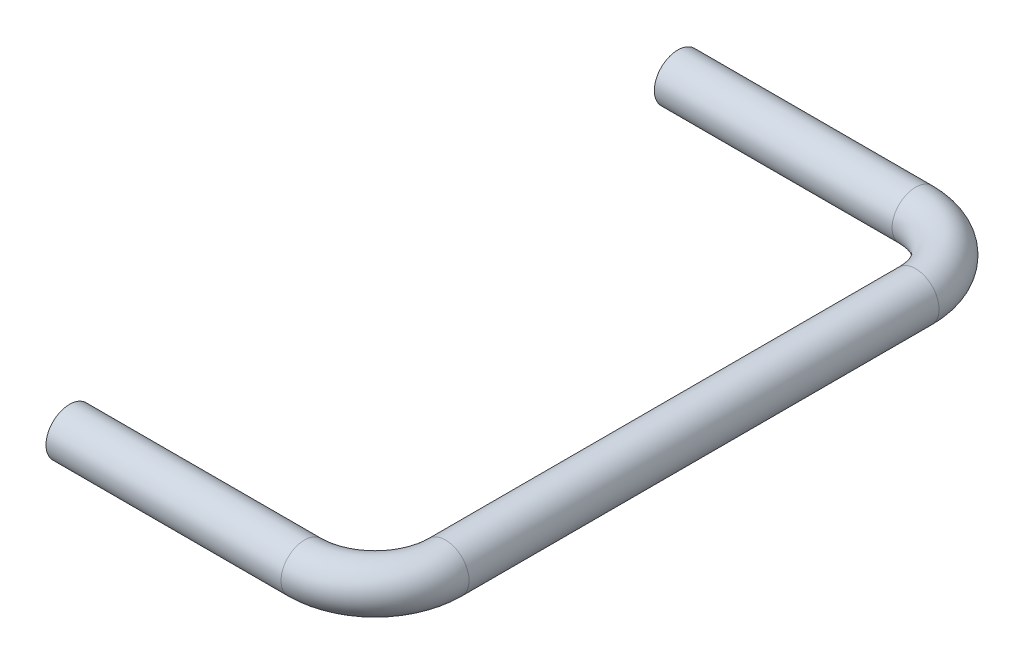
ISO-10303-21;
HEADER;
FILE_DESCRIPTION(('STEP AP214'),'2;1');
FILE_NAME('part.step','',(''),(''),'','','');
FILE_SCHEMA(('AUTOMOTIVE_DESIGN { 1 0 10303 214 1 1 1 1 }'));
ENDSEC;
DATA;
#1=APPLICATION_CONTEXT('core data for automotive mechanical design processes');
#2=APPLICATION_PROTOCOL_DEFINITION('international standard','automotive_design',2000,#1);
#3=PRODUCT_CONTEXT('',#1,'mechanical');
#4=PRODUCT('Part','Part','',(#3));
#5=PRODUCT_RELATED_PRODUCT_CATEGORY('part','',(#4));
#6=PRODUCT_DEFINITION_FORMATION('','',#4);
#7=PRODUCT_DEFINITION_CONTEXT('part definition',#1,'design');
#8=PRODUCT_DEFINITION('design','',#6,#7);
#9=PRODUCT_DEFINITION_SHAPE('','',#8);
#10=(LENGTH_UNIT() NAMED_UNIT(*) SI_UNIT(.MILLI.,.METRE.));
#11=(NAMED_UNIT(*) PLANE_ANGLE_UNIT() SI_UNIT($,.RADIAN.));
#12=(NAMED_UNIT(*) SI_UNIT($,.STERADIAN.) SOLID_ANGLE_UNIT());
#13=UNCERTAINTY_MEASURE_WITH_UNIT(LENGTH_MEASURE(1.E-05),#10,'distance_accuracy_value','');
#14=(GEOMETRIC_REPRESENTATION_CONTEXT(3) GLOBAL_UNCERTAINTY_ASSIGNED_CONTEXT((#13)) GLOBAL_UNIT_ASSIGNED_CONTEXT((#10,
#11,#12)) REPRESENTATION_CONTEXT('',''));
#15=CARTESIAN_POINT('',(0.,0.,0.));
#16=DIRECTION('',(0.,0.,1.));
#17=DIRECTION('',(1.,0.,0.));
#18=AXIS2_PLACEMENT_3D('',#15,#16,#17);
#19=CARTESIAN_POINT('',(10.,0.,-26.));
#20=DIRECTION('',(-1.,0.,0.));
#21=DIRECTION('',(0.,0.,1.));
#22=AXIS2_PLACEMENT_3D('',#19,#20,#21);
#23=CYLINDRICAL_SURFACE('',#22,1.);
#24=CARTESIAN_POINT('',(10.,0.,-26.));
#25=DIRECTION('',(-1.,0.,0.));
#26=DIRECTION('',(0.,0.,1.));
#27=AXIS2_PLACEMENT_3D('',#24,#25,#26);
#28=CIRCLE('',#27,1.);
#29=CARTESIAN_POINT('',(10.,0.,-27.));
#30=VERTEX_POINT('',#29);
#31=EDGE_CURVE('E39',#30,#30,#28,.T.);
#32=ORIENTED_EDGE('',*,*,#31,.T.);
#33=EDGE_LOOP('',(#32));
#34=FACE_BOUND('',#33,.T.);
#35=CARTESIAN_POINT('',(-0.116555463762325,0.,-26.));
#36=DIRECTION('',(-1.,0.,0.));
#37=DIRECTION('',(0.,0.,1.));
#38=AXIS2_PLACEMENT_3D('',#35,#36,#37);
#39=CIRCLE('',#38,1.);
#40=CARTESIAN_POINT('',(-0.116555463762325,0.,-25.));
#41=VERTEX_POINT('',#40);
#42=EDGE_CURVE('E10',#41,#41,#39,.T.);
#43=ORIENTED_EDGE('',*,*,#42,.F.);
#44=EDGE_LOOP('',(#43));
#45=FACE_BOUND('',#44,.T.);
#46=ADVANCED_FACE('F33',(#34,#45),#23,.T.);
#47=CARTESIAN_POINT('',(10.,0.,-23.));
#48=DIRECTION('',(0.,1.,0.));
#49=DIRECTION('',(0.,0.,1.));
#50=AXIS2_PLACEMENT_3D('',#47,#48,#49);
#51=TOROIDAL_SURFACE('',#50,3.,1.);
#52=CARTESIAN_POINT('',(13.,0.,-23.));
#53=DIRECTION('',(0.,0.,-1.));
#54=DIRECTION('',(-1.,0.,0.));
#55=AXIS2_PLACEMENT_3D('',#52,#53,#54);
#56=CIRCLE('',#55,1.);
#57=CARTESIAN_POINT('',(14.,0.,-23.));
#58=VERTEX_POINT('',#57);
#59=EDGE_CURVE('E43',#58,#58,#56,.T.);
#60=CARTESIAN_POINT('',(10.,0.,-23.));
#61=DIRECTION('',(0.,1.,0.));
#62=DIRECTION('',(0.,0.,1.));
#63=AXIS2_PLACEMENT_3D('',#60,#61,#62);
#64=CIRCLE('',#63,4.);
#65=EDGE_CURVE('',#58,#30,#64,.T.);
#66=ORIENTED_EDGE('',*,*,#59,.T.);
#67=ORIENTED_EDGE('',*,*,#31,.F.);
#68=ORIENTED_EDGE('',*,*,#65,.T.);
#69=ORIENTED_EDGE('',*,*,#65,.F.);
#70=EDGE_LOOP('',(#66,#68,#67,#69));
#71=FACE_BOUND('',#70,.T.);
#72=ADVANCED_FACE('F77',(#71),#51,.T.);
#73=CARTESIAN_POINT('',(13.,0.,-3.));
#74=DIRECTION('',(0.,0.,-1.));
#75=DIRECTION('',(-1.,0.,0.));
#76=AXIS2_PLACEMENT_3D('',#73,#74,#75);
#77=CYLINDRICAL_SURFACE('',#76,1.);
#78=CARTESIAN_POINT('',(13.,0.,-3.));
#79=DIRECTION('',(0.,0.,-1.));
#80=DIRECTION('',(-1.,0.,0.));
#81=AXIS2_PLACEMENT_3D('',#78,#79,#80);
#82=CIRCLE('',#81,1.);
#83=CARTESIAN_POINT('',(14.,0.,-3.));
#84=VERTEX_POINT('',#83);
#85=EDGE_CURVE('E47',#84,#84,#82,.T.);
#86=ORIENTED_EDGE('',*,*,#85,.T.);
#87=EDGE_LOOP('',(#86));
#88=FACE_BOUND('',#87,.T.);
#89=ORIENTED_EDGE('',*,*,#59,.F.);
#90=EDGE_LOOP('',(#89));
#91=FACE_BOUND('',#90,.T.);
#92=ADVANCED_FACE('F81',(#88,#91),#77,.T.);
#93=CARTESIAN_POINT('',(10.,0.,-3.));
#94=DIRECTION('',(0.,1.,0.));
#95=DIRECTION('',(0.,0.,1.));
#96=AXIS2_PLACEMENT_3D('',#93,#94,#95);
#97=TOROIDAL_SURFACE('',#96,3.,1.);
#98=CARTESIAN_POINT('',(10.,0.,0.));
#99=DIRECTION('',(1.,0.,0.));
#100=DIRECTION('',(0.,0.,-1.));
#101=AXIS2_PLACEMENT_3D('',#98,#99,#100);
#102=CIRCLE('',#101,1.);
#103=CARTESIAN_POINT('',(10.,0.,1.));
#104=VERTEX_POINT('',#103);
#105=EDGE_CURVE('E52',#104,#104,#102,.T.);
#106=CARTESIAN_POINT('',(10.,0.,-3.));
#107=DIRECTION('',(0.,1.,0.));
#108=DIRECTION('',(0.,0.,1.));
#109=AXIS2_PLACEMENT_3D('',#106,#107,#108);
#110=CIRCLE('',#109,4.);
#111=EDGE_CURVE('',#104,#84,#110,.T.);
#112=ORIENTED_EDGE('',*,*,#105,.T.);
#113=ORIENTED_EDGE('',*,*,#85,.F.);
#114=ORIENTED_EDGE('',*,*,#111,.T.);
#115=ORIENTED_EDGE('',*,*,#111,.F.);
#116=EDGE_LOOP('',(#112,#114,#113,#115));
#117=FACE_BOUND('',#116,.T.);
#118=ADVANCED_FACE('F59',(#117),#97,.T.);
#119=CARTESIAN_POINT('',(10.,0.,0.));
#120=DIRECTION('',(-1.,0.,0.));
#121=DIRECTION('',(0.,0.,1.));
#122=AXIS2_PLACEMENT_3D('',#119,#120,#121);
#123=CYLINDRICAL_SURFACE('',#122,1.);
#124=ORIENTED_EDGE('',*,*,#105,.F.);
#125=EDGE_LOOP('',(#124));
#126=FACE_BOUND('',#125,.T.);
#127=CARTESIAN_POINT('',(0.,0.,0.));
#128=DIRECTION('',(1.,0.,0.));
#129=DIRECTION('',(0.,0.,-1.));
#130=AXIS2_PLACEMENT_3D('',#127,#128,#129);
#131=CIRCLE('',#130,1.);
#132=CARTESIAN_POINT('',(0.,0.,-1.));
#133=VERTEX_POINT('',#132);
#134=EDGE_CURVE('E53',#133,#133,#131,.T.);
#135=ORIENTED_EDGE('',*,*,#134,.T.);
#136=EDGE_LOOP('',(#135));
#137=FACE_BOUND('',#136,.T.);
#138=ADVANCED_FACE('F62',(#126,#137),#123,.T.);
#139=CARTESIAN_POINT('',(-0.116555463762325,0.,-26.));
#140=DIRECTION('',(-1.,0.,0.));
#141=DIRECTION('',(0.,0.,1.));
#142=AXIS2_PLACEMENT_3D('',#139,#140,#141);
#143=PLANE('',#142);
#144=ORIENTED_EDGE('',*,*,#42,.T.);
#145=EDGE_LOOP('',(#144));
#146=FACE_BOUND('',#145,.T.);
#147=ADVANCED_FACE('F65',(#146),#143,.T.);
#148=CARTESIAN_POINT('',(0.,0.,0.));
#149=DIRECTION('',(1.,0.,0.));
#150=DIRECTION('',(0.,0.,-1.));
#151=AXIS2_PLACEMENT_3D('',#148,#149,#150);
#152=PLANE('',#151);
#153=ORIENTED_EDGE('',*,*,#134,.F.);
#154=EDGE_LOOP('',(#153));
#155=FACE_BOUND('',#154,.T.);
#156=ADVANCED_FACE('F69',(#155),#152,.F.);
#157=CLOSED_SHELL('',(#46,#72,#92,#118,#138,#147,#156));
#158=MANIFOLD_SOLID_BREP('B2',#157);
#159=ADVANCED_BREP_SHAPE_REPRESENTATION('',(#18,#158),#14);
#160=SHAPE_DEFINITION_REPRESENTATION(#9,#159);
ENDSEC;
END-ISO-10303-21;
